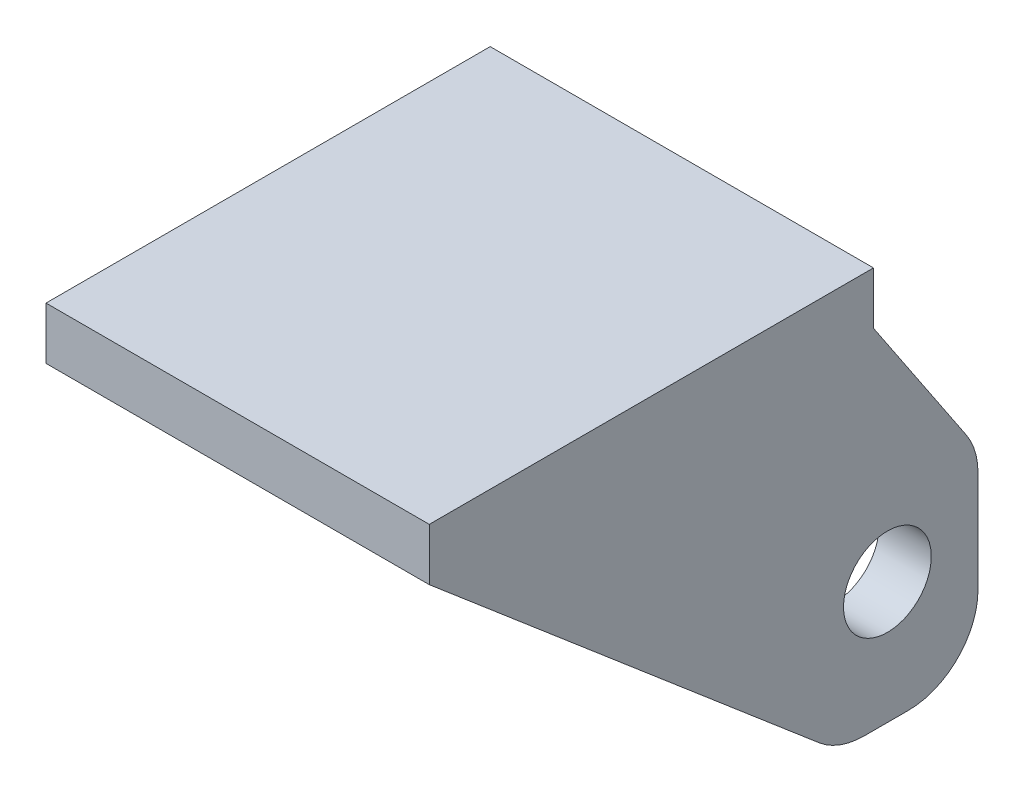
ISO-10303-21;
HEADER;
FILE_DESCRIPTION(('STEP AP214'),'2;1');
FILE_NAME('part.step','',(''),(''),'','','');
FILE_SCHEMA(('AUTOMOTIVE_DESIGN { 1 0 10303 214 1 1 1 1 }'));
ENDSEC;
DATA;
#1=APPLICATION_CONTEXT('core data for automotive mechanical design processes');
#2=APPLICATION_PROTOCOL_DEFINITION('international standard','automotive_design',2000,#1);
#3=PRODUCT_CONTEXT('',#1,'mechanical');
#4=PRODUCT('Part','Part','',(#3));
#5=PRODUCT_RELATED_PRODUCT_CATEGORY('part','',(#4));
#6=PRODUCT_DEFINITION_FORMATION('','',#4);
#7=PRODUCT_DEFINITION_CONTEXT('part definition',#1,'design');
#8=PRODUCT_DEFINITION('design','',#6,#7);
#9=PRODUCT_DEFINITION_SHAPE('','',#8);
#10=(LENGTH_UNIT() NAMED_UNIT(*) SI_UNIT(.MILLI.,.METRE.));
#11=(NAMED_UNIT(*) PLANE_ANGLE_UNIT() SI_UNIT($,.RADIAN.));
#12=(NAMED_UNIT(*) SI_UNIT($,.STERADIAN.) SOLID_ANGLE_UNIT());
#13=UNCERTAINTY_MEASURE_WITH_UNIT(LENGTH_MEASURE(1.E-05),#10,'distance_accuracy_value','');
#14=(GEOMETRIC_REPRESENTATION_CONTEXT(3) GLOBAL_UNCERTAINTY_ASSIGNED_CONTEXT((#13)) GLOBAL_UNIT_ASSIGNED_CONTEXT((#10,
#11,#12)) REPRESENTATION_CONTEXT('',''));
#15=CARTESIAN_POINT('',(0.,0.,0.));
#16=DIRECTION('',(0.,0.,1.));
#17=DIRECTION('',(1.,0.,0.));
#18=AXIS2_PLACEMENT_3D('',#15,#16,#17);
#19=CARTESIAN_POINT('',(0.,4.7625,-25.));
#20=DIRECTION('',(0.,0.,-1.));
#21=DIRECTION('',(1.,0.,0.));
#22=AXIS2_PLACEMENT_3D('',#19,#20,#21);
#23=PLANE('',#22);
#24=DIRECTION('',(0.,1.,0.));
#25=VECTOR('',#24,1.);
#26=CARTESIAN_POINT('',(-12.7,-31.75,-25.));
#27=LINE('',#26,#25);
#28=CARTESIAN_POINT('',(-12.7,-25.4,-25.));
#29=VERTEX_POINT('',#28);
#30=CARTESIAN_POINT('',(-12.7,-16.1746990921694,-25.));
#31=VERTEX_POINT('',#30);
#32=EDGE_CURVE('E338',#29,#31,#27,.T.);
#33=ORIENTED_EDGE('',*,*,#32,.F.);
#34=DIRECTION('',(-1.,0.,0.));
#35=VECTOR('',#34,1.);
#36=CARTESIAN_POINT('',(-12.7,-25.4,-25.));
#37=LINE('',#36,#35);
#38=CARTESIAN_POINT('',(-17.4625,-25.4,-25.));
#39=VERTEX_POINT('',#38);
#40=EDGE_CURVE('E263',#39,#29,#37,.F.);
#41=ORIENTED_EDGE('',*,*,#40,.F.);
#42=DIRECTION('',(0.,-1.,0.));
#43=VECTOR('',#42,1.);
#44=CARTESIAN_POINT('',(-17.4625,4.7625,-25.));
#45=LINE('',#44,#43);
#46=CARTESIAN_POINT('',(-17.4625,-16.1746990921694,-25.));
#47=VERTEX_POINT('',#46);
#48=EDGE_CURVE('E205',#47,#39,#45,.T.);
#49=ORIENTED_EDGE('',*,*,#48,.F.);
#50=DIRECTION('',(1.,0.,0.));
#51=VECTOR('',#50,1.);
#52=CARTESIAN_POINT('',(-17.4625,-16.1746990921694,-25.));
#53=LINE('',#52,#51);
#54=EDGE_CURVE('E266',#31,#47,#53,.F.);
#55=ORIENTED_EDGE('',*,*,#54,.F.);
#56=EDGE_LOOP('',(#33,#41,#49,#55));
#57=FACE_BOUND('',#56,.T.);
#58=ADVANCED_FACE('F39',(#57),#23,.T.);
#59=CARTESIAN_POINT('',(0.,0.,0.));
#60=DIRECTION('',(0.,1.,0.));
#61=DIRECTION('',(0.,0.,-1.));
#62=AXIS2_PLACEMENT_3D('',#59,#60,#61);
#63=PLANE('',#62);
#64=DIRECTION('',(-1.,0.,0.));
#65=VECTOR('',#64,1.);
#66=CARTESIAN_POINT('',(0.,0.,25.));
#67=LINE('',#66,#65);
#68=CARTESIAN_POINT('',(7.9375,0.,25.));
#69=VERTEX_POINT('',#68);
#70=CARTESIAN_POINT('',(-7.9375,0.,25.));
#71=VERTEX_POINT('',#70);
#72=EDGE_CURVE('E341',#69,#71,#67,.T.);
#73=ORIENTED_EDGE('',*,*,#72,.T.);
#74=DIRECTION('',(0.,0.,1.));
#75=VECTOR('',#74,1.);
#76=CARTESIAN_POINT('',(-7.9375,0.,0.));
#77=LINE('',#76,#75);
#78=CARTESIAN_POINT('',(-7.9375,0.,-15.475));
#79=VERTEX_POINT('',#78);
#80=EDGE_CURVE('E279',#79,#71,#77,.T.);
#81=ORIENTED_EDGE('',*,*,#80,.F.);
#82=DIRECTION('',(1.,0.,0.));
#83=VECTOR('',#82,1.);
#84=CARTESIAN_POINT('',(-17.4625,0.,-15.475));
#85=LINE('',#84,#83);
#86=CARTESIAN_POINT('',(7.9375,0.,-15.475));
#87=VERTEX_POINT('',#86);
#88=EDGE_CURVE('E365',#79,#87,#85,.T.);
#89=ORIENTED_EDGE('',*,*,#88,.T.);
#90=DIRECTION('',(0.,0.,1.));
#91=VECTOR('',#90,1.);
#92=CARTESIAN_POINT('',(7.9375,0.,-15.475));
#93=LINE('',#92,#91);
#94=EDGE_CURVE('E281',#69,#87,#93,.F.);
#95=ORIENTED_EDGE('',*,*,#94,.F.);
#96=EDGE_LOOP('',(#73,#81,#89,#95));
#97=FACE_BOUND('',#96,.T.);
#98=ADVANCED_FACE('F401',(#97),#63,.F.);
#99=CARTESIAN_POINT('',(0.,4.7625,25.));
#100=DIRECTION('',(0.,0.,-1.));
#101=DIRECTION('',(1.,0.,0.));
#102=AXIS2_PLACEMENT_3D('',#99,#100,#101);
#103=PLANE('',#102);
#104=DIRECTION('',(0.,-1.,0.));
#105=VECTOR('',#104,1.);
#106=CARTESIAN_POINT('',(17.4625,4.7625,25.));
#107=LINE('',#106,#105);
#108=CARTESIAN_POINT('',(17.4625,4.7625,25.));
#109=VERTEX_POINT('',#108);
#110=CARTESIAN_POINT('',(17.4625,0.,25.));
#111=VERTEX_POINT('',#110);
#112=EDGE_CURVE('E348',#109,#111,#107,.T.);
#113=ORIENTED_EDGE('',*,*,#112,.F.);
#114=DIRECTION('',(-1.,0.,0.));
#115=VECTOR('',#114,1.);
#116=CARTESIAN_POINT('',(0.,4.7625,25.));
#117=LINE('',#116,#115);
#118=CARTESIAN_POINT('',(-17.4625,4.7625,25.));
#119=VERTEX_POINT('',#118);
#120=EDGE_CURVE('E203',#109,#119,#117,.T.);
#121=ORIENTED_EDGE('',*,*,#120,.T.);
#122=DIRECTION('',(0.,-1.,0.));
#123=VECTOR('',#122,1.);
#124=CARTESIAN_POINT('',(-17.4625,4.7625,25.));
#125=LINE('',#124,#123);
#126=CARTESIAN_POINT('',(-17.4625,0.,25.));
#127=VERTEX_POINT('',#126);
#128=EDGE_CURVE('E186',#119,#127,#125,.T.);
#129=ORIENTED_EDGE('',*,*,#128,.T.);
#130=DIRECTION('',(1.,0.,0.));
#131=VECTOR('',#130,1.);
#132=CARTESIAN_POINT('',(-17.4625,0.,25.));
#133=LINE('',#132,#131);
#134=EDGE_CURVE('E194',#127,#71,#133,.T.);
#135=ORIENTED_EDGE('',*,*,#134,.T.);
#136=ORIENTED_EDGE('',*,*,#72,.F.);
#137=EDGE_CURVE('E191',#69,#111,#133,.T.);
#138=ORIENTED_EDGE('',*,*,#137,.T.);
#139=EDGE_LOOP('',(#113,#121,#129,#135,#136,#138));
#140=FACE_BOUND('',#139,.T.);
#141=ADVANCED_FACE('F201',(#140),#103,.F.);
#142=CARTESIAN_POINT('',(-17.4625,4.7625,0.));
#143=DIRECTION('',(1.,0.,0.));
#144=DIRECTION('',(0.,0.,1.));
#145=AXIS2_PLACEMENT_3D('',#142,#143,#144);
#146=PLANE('',#145);
#147=CARTESIAN_POINT('',(-17.4625,-20.6375,-16.745));
#148=DIRECTION('',(-1.,0.,0.));
#149=DIRECTION('',(0.,0.,1.));
#150=AXIS2_PLACEMENT_3D('',#147,#148,#149);
#151=CIRCLE('',#150,4.);
#152=CARTESIAN_POINT('',(-17.4625,-20.6375,-12.745));
#153=VERTEX_POINT('',#152);
#154=EDGE_CURVE('E380',#153,#153,#151,.T.);
#155=ORIENTED_EDGE('',*,*,#154,.F.);
#156=EDGE_LOOP('',(#155));
#157=FACE_BOUND('',#156,.T.);
#158=DIRECTION('',(0.,-0.648181604007245,-0.761485789904575));
#159=VECTOR('',#158,1.);
#160=CARTESIAN_POINT('',(-17.4625,-12.3395270182268,10.5034847943351));
#161=LINE('',#160,#159);
#162=CARTESIAN_POINT('',(-17.4625,-30.2354347658941,-10.5206839926881));
#163=VERTEX_POINT('',#162);
#164=EDGE_CURVE('E182',#127,#163,#161,.T.);
#165=ORIENTED_EDGE('',*,*,#164,.F.);
#166=ORIENTED_EDGE('',*,*,#128,.F.);
#167=DIRECTION('',(0.,0.,-1.));
#168=VECTOR('',#167,1.);
#169=CARTESIAN_POINT('',(-17.4625,4.7625,0.));
#170=LINE('',#169,#168);
#171=CARTESIAN_POINT('',(-17.4625,4.7625,-15.475));
#172=VERTEX_POINT('',#171);
#173=EDGE_CURVE('E343',#119,#172,#170,.T.);
#174=ORIENTED_EDGE('',*,*,#173,.T.);
#175=DIRECTION('',(0.,1.,0.));
#176=VECTOR('',#175,1.);
#177=CARTESIAN_POINT('',(-17.4625,0.,-15.475));
#178=LINE('',#177,#176);
#179=CARTESIAN_POINT('',(-17.4625,0.,-15.475));
#180=VERTEX_POINT('',#179);
#181=EDGE_CURVE('E364',#180,#172,#178,.T.);
#182=ORIENTED_EDGE('',*,*,#181,.F.);
#183=DIRECTION('',(0.,0.831333189373505,0.555774350115293));
#184=VECTOR('',#183,1.);
#185=CARTESIAN_POINT('',(-17.4625,7.14997093575034,-10.695002640392));
#186=LINE('',#185,#184);
#187=CARTESIAN_POINT('',(-17.4625,-12.6455319689373,-23.9289657525218));
#188=VERTEX_POINT('',#187);
#189=EDGE_CURVE('E372',#188,#180,#186,.T.);
#190=ORIENTED_EDGE('',*,*,#189,.F.);
#191=CARTESIAN_POINT('',(-17.4625,-16.1746990921694,-18.65));
#192=DIRECTION('',(-1.,0.,0.));
#193=DIRECTION('',(0.,0.,1.));
#194=AXIS2_PLACEMENT_3D('',#191,#192,#193);
#195=CIRCLE('',#194,6.35);
#196=EDGE_CURVE('E235',#47,#188,#195,.F.);
#197=ORIENTED_EDGE('',*,*,#196,.F.);
#198=ORIENTED_EDGE('',*,*,#48,.T.);
#199=CARTESIAN_POINT('',(-17.4625,-25.4,-18.65));
#200=DIRECTION('',(-1.,0.,0.));
#201=DIRECTION('',(0.,0.,1.));
#202=AXIS2_PLACEMENT_3D('',#199,#200,#201);
#203=CIRCLE('',#202,6.35);
#204=CARTESIAN_POINT('',(-17.4625,-31.75,-18.65));
#205=VERTEX_POINT('',#204);
#206=EDGE_CURVE('E233',#205,#39,#203,.F.);
#207=ORIENTED_EDGE('',*,*,#206,.F.);
#208=DIRECTION('',(0.,0.,-1.));
#209=VECTOR('',#208,1.);
#210=CARTESIAN_POINT('',(-17.4625,-31.75,0.));
#211=LINE('',#210,#209);
#212=CARTESIAN_POINT('',(-17.4625,-31.75,-14.6366371781341));
#213=VERTEX_POINT('',#212);
#214=EDGE_CURVE('E314',#213,#205,#211,.T.);
#215=ORIENTED_EDGE('',*,*,#214,.F.);
#216=CARTESIAN_POINT('',(-17.4625,-25.4,-14.6366371781341));
#217=DIRECTION('',(-1.,0.,0.));
#218=DIRECTION('',(0.,0.,1.));
#219=AXIS2_PLACEMENT_3D('',#216,#217,#218);
#220=CIRCLE('',#219,6.35);
#221=EDGE_CURVE('E190',#163,#213,#220,.F.);
#222=ORIENTED_EDGE('',*,*,#221,.F.);
#223=EDGE_LOOP('',(#165,#166,#174,#182,#190,#197,#198,#207,#215,#222));
#224=FACE_BOUND('',#223,.T.);
#225=ADVANCED_FACE('F183',(#157,#224),#146,.F.);
#226=DIRECTION('',(0.,-1.,0.));
#227=VECTOR('',#226,1.);
#228=CARTESIAN_POINT('',(17.4625,4.7625,-25.));
#229=LINE('',#228,#227);
#230=CARTESIAN_POINT('',(17.4625,-16.1746990921694,-25.));
#231=VERTEX_POINT('',#230);
#232=CARTESIAN_POINT('',(17.4625,-25.4,-25.));
#233=VERTEX_POINT('',#232);
#234=EDGE_CURVE('E211',#231,#233,#229,.T.);
#235=ORIENTED_EDGE('',*,*,#234,.T.);
#236=DIRECTION('',(1.,0.,0.));
#237=VECTOR('',#236,1.);
#238=CARTESIAN_POINT('',(17.4625,-25.4,-25.));
#239=LINE('',#238,#237);
#240=CARTESIAN_POINT('',(12.7,-25.4,-25.));
#241=VERTEX_POINT('',#240);
#242=EDGE_CURVE('E271',#241,#233,#239,.T.);
#243=ORIENTED_EDGE('',*,*,#242,.F.);
#244=DIRECTION('',(0.,1.,0.));
#245=VECTOR('',#244,1.);
#246=CARTESIAN_POINT('',(12.7,-31.75,-25.));
#247=LINE('',#246,#245);
#248=CARTESIAN_POINT('',(12.7,-16.1746990921694,-25.));
#249=VERTEX_POINT('',#248);
#250=EDGE_CURVE('E310',#241,#249,#247,.T.);
#251=ORIENTED_EDGE('',*,*,#250,.T.);
#252=DIRECTION('',(1.,0.,0.));
#253=VECTOR('',#252,1.);
#254=CARTESIAN_POINT('',(12.7,-16.1746990921694,-25.));
#255=LINE('',#254,#253);
#256=EDGE_CURVE('E274',#231,#249,#255,.F.);
#257=ORIENTED_EDGE('',*,*,#256,.F.);
#258=EDGE_LOOP('',(#235,#243,#251,#257));
#259=FACE_BOUND('',#258,.T.);
#260=ADVANCED_FACE('F318',(#259),#23,.T.);
#261=CARTESIAN_POINT('',(17.4625,4.7625,0.));
#262=DIRECTION('',(1.,0.,0.));
#263=DIRECTION('',(0.,0.,1.));
#264=AXIS2_PLACEMENT_3D('',#261,#262,#263);
#265=PLANE('',#264);
#266=DIRECTION('',(0.,0.,-1.));
#267=VECTOR('',#266,1.);
#268=CARTESIAN_POINT('',(17.4625,-31.75,0.));
#269=LINE('',#268,#267);
#270=CARTESIAN_POINT('',(17.4625,-31.75,-14.6366371781341));
#271=VERTEX_POINT('',#270);
#272=CARTESIAN_POINT('',(17.4625,-31.75,-18.65));
#273=VERTEX_POINT('',#272);
#274=EDGE_CURVE('E327',#271,#273,#269,.T.);
#275=ORIENTED_EDGE('',*,*,#274,.T.);
#276=CARTESIAN_POINT('',(17.4625,-25.4,-18.65));
#277=DIRECTION('',(-1.,0.,0.));
#278=DIRECTION('',(0.,0.,1.));
#279=AXIS2_PLACEMENT_3D('',#276,#277,#278);
#280=CIRCLE('',#279,6.35);
#281=EDGE_CURVE('E243',#233,#273,#280,.T.);
#282=ORIENTED_EDGE('',*,*,#281,.F.);
#283=ORIENTED_EDGE('',*,*,#234,.F.);
#284=CARTESIAN_POINT('',(17.4625,-16.1746990921694,-18.65));
#285=DIRECTION('',(-1.,0.,0.));
#286=DIRECTION('',(0.,0.,1.));
#287=AXIS2_PLACEMENT_3D('',#284,#285,#286);
#288=CIRCLE('',#287,6.35);
#289=CARTESIAN_POINT('',(17.4625,-12.6455319689373,-23.9289657525218));
#290=VERTEX_POINT('',#289);
#291=EDGE_CURVE('E246',#290,#231,#288,.T.);
#292=ORIENTED_EDGE('',*,*,#291,.F.);
#293=DIRECTION('',(0.,0.831333189373505,0.555774350115293));
#294=VECTOR('',#293,1.);
#295=CARTESIAN_POINT('',(17.4625,7.14997093575034,-10.695002640392));
#296=LINE('',#295,#294);
#297=CARTESIAN_POINT('',(17.4625,0.,-15.475));
#298=VERTEX_POINT('',#297);
#299=EDGE_CURVE('E302',#290,#298,#296,.T.);
#300=ORIENTED_EDGE('',*,*,#299,.T.);
#301=DIRECTION('',(0.,1.,0.));
#302=VECTOR('',#301,1.);
#303=CARTESIAN_POINT('',(17.4625,0.,-15.475));
#304=LINE('',#303,#302);
#305=CARTESIAN_POINT('',(17.4625,4.7625,-15.475));
#306=VERTEX_POINT('',#305);
#307=EDGE_CURVE('E370',#298,#306,#304,.T.);
#308=ORIENTED_EDGE('',*,*,#307,.T.);
#309=DIRECTION('',(0.,0.,-1.));
#310=VECTOR('',#309,1.);
#311=CARTESIAN_POINT('',(17.4625,4.7625,0.));
#312=LINE('',#311,#310);
#313=EDGE_CURVE('E345',#109,#306,#312,.T.);
#314=ORIENTED_EDGE('',*,*,#313,.F.);
#315=ORIENTED_EDGE('',*,*,#112,.T.);
#316=DIRECTION('',(0.,-0.648181604007245,-0.761485789904575));
#317=VECTOR('',#316,1.);
#318=CARTESIAN_POINT('',(17.4625,-12.3395270182268,10.5034847943351));
#319=LINE('',#318,#317);
#320=CARTESIAN_POINT('',(17.4625,-30.2354347658941,-10.5206839926881));
#321=VERTEX_POINT('',#320);
#322=EDGE_CURVE('E192',#111,#321,#319,.T.);
#323=ORIENTED_EDGE('',*,*,#322,.T.);
#324=CARTESIAN_POINT('',(17.4625,-25.4,-14.6366371781341));
#325=DIRECTION('',(-1.,0.,0.));
#326=DIRECTION('',(0.,0.,1.));
#327=AXIS2_PLACEMENT_3D('',#324,#325,#326);
#328=CIRCLE('',#327,6.35);
#329=EDGE_CURVE('E248',#271,#321,#328,.T.);
#330=ORIENTED_EDGE('',*,*,#329,.F.);
#331=EDGE_LOOP('',(#275,#282,#283,#292,#300,#308,#314,#315,#323,#330));
#332=FACE_BOUND('',#331,.T.);
#333=CARTESIAN_POINT('',(17.4625,-20.6375,-16.745));
#334=DIRECTION('',(-1.,0.,0.));
#335=DIRECTION('',(0.,0.,1.));
#336=AXIS2_PLACEMENT_3D('',#333,#334,#335);
#337=CIRCLE('',#336,4.);
#338=CARTESIAN_POINT('',(17.4625,-20.6375,-12.745));
#339=VERTEX_POINT('',#338);
#340=EDGE_CURVE('E369',#339,#339,#337,.T.);
#341=ORIENTED_EDGE('',*,*,#340,.T.);
#342=EDGE_LOOP('',(#341));
#343=FACE_BOUND('',#342,.T.);
#344=ADVANCED_FACE('F354',(#332,#343),#265,.T.);
#345=CARTESIAN_POINT('',(0.,4.7625,0.));
#346=DIRECTION('',(0.,1.,0.));
#347=DIRECTION('',(0.,0.,-1.));
#348=AXIS2_PLACEMENT_3D('',#345,#346,#347);
#349=PLANE('',#348);
#350=DIRECTION('',(1.,0.,0.));
#351=VECTOR('',#350,1.);
#352=CARTESIAN_POINT('',(-17.4625,4.7625,-15.475));
#353=LINE('',#352,#351);
#354=EDGE_CURVE('E367',#172,#306,#353,.T.);
#355=ORIENTED_EDGE('',*,*,#354,.F.);
#356=ORIENTED_EDGE('',*,*,#173,.F.);
#357=ORIENTED_EDGE('',*,*,#120,.F.);
#358=ORIENTED_EDGE('',*,*,#313,.T.);
#359=EDGE_LOOP('',(#355,#356,#357,#358));
#360=FACE_BOUND('',#359,.T.);
#361=ADVANCED_FACE('F417',(#360),#349,.T.);
#362=CARTESIAN_POINT('',(-12.7,-31.75,0.));
#363=DIRECTION('',(1.,0.,0.));
#364=DIRECTION('',(0.,0.,1.));
#365=AXIS2_PLACEMENT_3D('',#362,#363,#364);
#366=PLANE('',#365);
#367=DIRECTION('',(0.,-0.648181604007245,-0.761485789904575));
#368=VECTOR('',#367,1.);
#369=CARTESIAN_POINT('',(-12.7,-25.6789527070324,-5.16771451881289));
#370=LINE('',#369,#368);
#371=CARTESIAN_POINT('',(-12.7,-4.76249999999999,19.405));
#372=VERTEX_POINT('',#371);
#373=CARTESIAN_POINT('',(-12.7,-30.235434765894,-10.5206839926881));
#374=VERTEX_POINT('',#373);
#375=EDGE_CURVE('E218',#372,#374,#370,.T.);
#376=ORIENTED_EDGE('',*,*,#375,.T.);
#377=CARTESIAN_POINT('',(-12.7,-25.4,-14.6366371781341));
#378=DIRECTION('',(-1.,0.,0.));
#379=DIRECTION('',(0.,0.,1.));
#380=AXIS2_PLACEMENT_3D('',#377,#378,#379);
#381=CIRCLE('',#380,6.35);
#382=CARTESIAN_POINT('',(-12.7,-31.75,-14.6366371781341));
#383=VERTEX_POINT('',#382);
#384=EDGE_CURVE('E228',#383,#374,#381,.T.);
#385=ORIENTED_EDGE('',*,*,#384,.F.);
#386=DIRECTION('',(0.,0.,1.));
#387=VECTOR('',#386,1.);
#388=CARTESIAN_POINT('',(-12.7,-31.75,0.));
#389=LINE('',#388,#387);
#390=CARTESIAN_POINT('',(-12.7,-31.75,-18.65));
#391=VERTEX_POINT('',#390);
#392=EDGE_CURVE('E335',#391,#383,#389,.T.);
#393=ORIENTED_EDGE('',*,*,#392,.F.);
#394=CARTESIAN_POINT('',(-12.7,-25.4,-18.65));
#395=DIRECTION('',(-1.,0.,0.));
#396=DIRECTION('',(0.,0.,1.));
#397=AXIS2_PLACEMENT_3D('',#394,#395,#396);
#398=CIRCLE('',#397,6.35);
#399=EDGE_CURVE('E223',#29,#391,#398,.T.);
#400=ORIENTED_EDGE('',*,*,#399,.F.);
#401=ORIENTED_EDGE('',*,*,#32,.T.);
#402=CARTESIAN_POINT('',(-12.7,-16.1746990921694,-18.65));
#403=DIRECTION('',(-1.,0.,0.));
#404=DIRECTION('',(0.,0.,1.));
#405=AXIS2_PLACEMENT_3D('',#402,#403,#404);
#406=CIRCLE('',#405,6.35);
#407=CARTESIAN_POINT('',(-12.7,-12.6455319689373,-23.9289657525218));
#408=VERTEX_POINT('',#407);
#409=EDGE_CURVE('E226',#408,#31,#406,.T.);
#410=ORIENTED_EDGE('',*,*,#409,.F.);
#411=DIRECTION('',(0.,0.831333189373505,0.555774350115293));
#412=VECTOR('',#411,1.);
#413=CARTESIAN_POINT('',(-12.7,-14.7929262424368,-25.3645714423353));
#414=LINE('',#413,#412);
#415=CARTESIAN_POINT('',(-12.7,-4.7625,-18.6588923024579));
#416=VERTEX_POINT('',#415);
#417=EDGE_CURVE('E329',#408,#416,#414,.T.);
#418=ORIENTED_EDGE('',*,*,#417,.T.);
#419=DIRECTION('',(0.,0.,1.));
#420=VECTOR('',#419,1.);
#421=CARTESIAN_POINT('',(-12.7,-4.7625,0.));
#422=LINE('',#421,#420);
#423=EDGE_CURVE('E283',#372,#416,#422,.F.);
#424=ORIENTED_EDGE('',*,*,#423,.F.);
#425=EDGE_LOOP('',(#376,#385,#393,#400,#401,#410,#418,#424));
#426=FACE_BOUND('',#425,.T.);
#427=CARTESIAN_POINT('',(-12.7,-20.6375,-16.745));
#428=DIRECTION('',(-1.,0.,0.));
#429=DIRECTION('',(0.,0.,1.));
#430=AXIS2_PLACEMENT_3D('',#427,#428,#429);
#431=CIRCLE('',#430,4.);
#432=CARTESIAN_POINT('',(-12.7,-20.6375,-12.745));
#433=VERTEX_POINT('',#432);
#434=EDGE_CURVE('E217',#433,#433,#431,.T.);
#435=ORIENTED_EDGE('',*,*,#434,.T.);
#436=EDGE_LOOP('',(#435));
#437=FACE_BOUND('',#436,.T.);
#438=ADVANCED_FACE('F391',(#426,#437),#366,.T.);
#439=CARTESIAN_POINT('',(0.,-31.75,0.));
#440=DIRECTION('',(0.,1.,0.));
#441=DIRECTION('',(0.,0.,-1.));
#442=AXIS2_PLACEMENT_3D('',#439,#440,#441);
#443=PLANE('',#442);
#444=ORIENTED_EDGE('',*,*,#214,.T.);
#445=DIRECTION('',(-1.,0.,0.));
#446=VECTOR('',#445,1.);
#447=CARTESIAN_POINT('',(-17.4625,-31.75,-18.65));
#448=LINE('',#447,#446);
#449=EDGE_CURVE('E208',#391,#205,#448,.T.);
#450=ORIENTED_EDGE('',*,*,#449,.F.);
#451=ORIENTED_EDGE('',*,*,#392,.T.);
#452=DIRECTION('',(1.,0.,0.));
#453=VECTOR('',#452,1.);
#454=CARTESIAN_POINT('',(0.,-31.75,-14.6366371781341));
#455=LINE('',#454,#453);
#456=EDGE_CURVE('E221',#213,#383,#455,.T.);
#457=ORIENTED_EDGE('',*,*,#456,.F.);
#458=EDGE_LOOP('',(#444,#450,#451,#457));
#459=FACE_BOUND('',#458,.T.);
#460=ADVANCED_FACE('F552',(#459),#443,.F.);
#461=CARTESIAN_POINT('',(12.7,-31.75,0.));
#462=DIRECTION('',(1.,0.,0.));
#463=DIRECTION('',(0.,0.,1.));
#464=AXIS2_PLACEMENT_3D('',#461,#462,#463);
#465=PLANE('',#464);
#466=CARTESIAN_POINT('',(12.7,-20.6375,-16.745));
#467=DIRECTION('',(-1.,0.,0.));
#468=DIRECTION('',(0.,0.,1.));
#469=AXIS2_PLACEMENT_3D('',#466,#467,#468);
#470=CIRCLE('',#469,4.);
#471=CARTESIAN_POINT('',(12.7,-20.6375,-12.745));
#472=VERTEX_POINT('',#471);
#473=EDGE_CURVE('E215',#472,#472,#470,.T.);
#474=ORIENTED_EDGE('',*,*,#473,.F.);
#475=EDGE_LOOP('',(#474));
#476=FACE_BOUND('',#475,.T.);
#477=DIRECTION('',(0.,0.831333189373505,0.555774350115293));
#478=VECTOR('',#477,1.);
#479=CARTESIAN_POINT('',(12.7,-14.7929262424368,-25.3645714423353));
#480=LINE('',#479,#478);
#481=CARTESIAN_POINT('',(12.7,-12.6455319689373,-23.9289657525218));
#482=VERTEX_POINT('',#481);
#483=CARTESIAN_POINT('',(12.7,-4.7625,-18.6588923024579));
#484=VERTEX_POINT('',#483);
#485=EDGE_CURVE('E204',#482,#484,#480,.T.);
#486=ORIENTED_EDGE('',*,*,#485,.F.);
#487=CARTESIAN_POINT('',(12.7,-16.1746990921694,-18.65));
#488=DIRECTION('',(-1.,0.,0.));
#489=DIRECTION('',(0.,0.,1.));
#490=AXIS2_PLACEMENT_3D('',#487,#488,#489);
#491=CIRCLE('',#490,6.35);
#492=EDGE_CURVE('E255',#249,#482,#491,.F.);
#493=ORIENTED_EDGE('',*,*,#492,.F.);
#494=ORIENTED_EDGE('',*,*,#250,.F.);
#495=CARTESIAN_POINT('',(12.7,-25.4,-18.65));
#496=DIRECTION('',(-1.,0.,0.));
#497=DIRECTION('',(0.,0.,1.));
#498=AXIS2_PLACEMENT_3D('',#495,#496,#497);
#499=CIRCLE('',#498,6.35);
#500=CARTESIAN_POINT('',(12.7,-31.75,-18.65));
#501=VERTEX_POINT('',#500);
#502=EDGE_CURVE('E253',#501,#241,#499,.F.);
#503=ORIENTED_EDGE('',*,*,#502,.F.);
#504=DIRECTION('',(0.,0.,1.));
#505=VECTOR('',#504,1.);
#506=CARTESIAN_POINT('',(12.7,-31.75,0.));
#507=LINE('',#506,#505);
#508=CARTESIAN_POINT('',(12.7,-31.75,-14.6366371781341));
#509=VERTEX_POINT('',#508);
#510=EDGE_CURVE('E315',#501,#509,#507,.T.);
#511=ORIENTED_EDGE('',*,*,#510,.T.);
#512=CARTESIAN_POINT('',(12.7,-25.4,-14.6366371781341));
#513=DIRECTION('',(-1.,0.,0.));
#514=DIRECTION('',(0.,0.,1.));
#515=AXIS2_PLACEMENT_3D('',#512,#513,#514);
#516=CIRCLE('',#515,6.35);
#517=CARTESIAN_POINT('',(12.7,-30.235434765894,-10.5206839926881));
#518=VERTEX_POINT('',#517);
#519=EDGE_CURVE('E258',#518,#509,#516,.F.);
#520=ORIENTED_EDGE('',*,*,#519,.F.);
#521=DIRECTION('',(0.,-0.648181604007245,-0.761485789904575));
#522=VECTOR('',#521,1.);
#523=CARTESIAN_POINT('',(12.7,-25.6789527070324,-5.16771451881289));
#524=LINE('',#523,#522);
#525=CARTESIAN_POINT('',(12.7,-4.76249999999999,19.405));
#526=VERTEX_POINT('',#525);
#527=EDGE_CURVE('E198',#526,#518,#524,.T.);
#528=ORIENTED_EDGE('',*,*,#527,.F.);
#529=DIRECTION('',(0.,0.,1.));
#530=VECTOR('',#529,1.);
#531=CARTESIAN_POINT('',(12.7,-4.7625,25.));
#532=LINE('',#531,#530);
#533=EDGE_CURVE('E277',#484,#526,#532,.T.);
#534=ORIENTED_EDGE('',*,*,#533,.F.);
#535=EDGE_LOOP('',(#486,#493,#494,#503,#511,#520,#528,#534));
#536=FACE_BOUND('',#535,.T.);
#537=ADVANCED_FACE('F296',(#476,#536),#465,.F.);
#538=CARTESIAN_POINT('',(0.,-31.75,0.));
#539=DIRECTION('',(0.,1.,0.));
#540=DIRECTION('',(0.,0.,-1.));
#541=AXIS2_PLACEMENT_3D('',#538,#539,#540);
#542=PLANE('',#541);
#543=ORIENTED_EDGE('',*,*,#510,.F.);
#544=DIRECTION('',(1.,0.,0.));
#545=VECTOR('',#544,1.);
#546=CARTESIAN_POINT('',(12.7,-31.75,-18.65));
#547=LINE('',#546,#545);
#548=EDGE_CURVE('E239',#273,#501,#547,.F.);
#549=ORIENTED_EDGE('',*,*,#548,.F.);
#550=ORIENTED_EDGE('',*,*,#274,.F.);
#551=DIRECTION('',(1.,0.,0.));
#552=VECTOR('',#551,1.);
#553=CARTESIAN_POINT('',(0.,-31.75,-14.6366371781341));
#554=LINE('',#553,#552);
#555=EDGE_CURVE('E241',#509,#271,#554,.T.);
#556=ORIENTED_EDGE('',*,*,#555,.F.);
#557=EDGE_LOOP('',(#543,#549,#550,#556));
#558=FACE_BOUND('',#557,.T.);
#559=ADVANCED_FACE('F326',(#558),#542,.F.);
#560=CARTESIAN_POINT('',(-17.4625,-12.3395270182268,10.5034847943351));
#561=DIRECTION('',(0.,0.761485789904575,-0.648181604007245));
#562=DIRECTION('',(0.,-0.648181604007245,-0.761485789904575));
#563=AXIS2_PLACEMENT_3D('',#560,#561,#562);
#564=PLANE('',#563);
#565=ORIENTED_EDGE('',*,*,#322,.F.);
#566=ORIENTED_EDGE('',*,*,#137,.F.);
#567=CARTESIAN_POINT('',(7.9375,-4.7625,19.405));
#568=DIRECTION('',(0.,-0.761485789904575,0.648181604007245));
#569=DIRECTION('',(0.,-0.648181604007245,-0.761485789904575));
#570=AXIS2_PLACEMENT_3D('',#567,#568,#569);
#571=ELLIPSE('',#570,7.3474778836006,4.7625);
#572=EDGE_CURVE('E61',#526,#69,#571,.T.);
#573=ORIENTED_EDGE('',*,*,#572,.F.);
#574=ORIENTED_EDGE('',*,*,#527,.T.);
#575=DIRECTION('',(1.,0.,0.));
#576=VECTOR('',#575,1.);
#577=CARTESIAN_POINT('',(-17.4625,-30.2354347658941,-10.5206839926881));
#578=LINE('',#577,#576);
#579=EDGE_CURVE('E251',#321,#518,#578,.F.);
#580=ORIENTED_EDGE('',*,*,#579,.F.);
#581=EDGE_LOOP('',(#565,#566,#573,#574,#580));
#582=FACE_BOUND('',#581,.T.);
#583=ADVANCED_FACE('F504',(#582),#564,.F.);
#584=CARTESIAN_POINT('',(-17.4625,-20.6375,-16.745));
#585=DIRECTION('',(1.,0.,0.));
#586=DIRECTION('',(0.,0.,1.));
#587=AXIS2_PLACEMENT_3D('',#584,#585,#586);
#588=CYLINDRICAL_SURFACE('',#587,4.);
#589=ORIENTED_EDGE('',*,*,#340,.F.);
#590=EDGE_LOOP('',(#589));
#591=FACE_BOUND('',#590,.T.);
#592=ORIENTED_EDGE('',*,*,#473,.T.);
#593=EDGE_LOOP('',(#592));
#594=FACE_BOUND('',#593,.T.);
#595=ADVANCED_FACE('F495',(#591,#594),#588,.F.);
#596=CARTESIAN_POINT('',(-17.4625,7.14997093575034,-10.695002640392));
#597=DIRECTION('',(0.,-0.555774350115293,0.831333189373505));
#598=DIRECTION('',(0.,0.831333189373505,0.555774350115293));
#599=AXIS2_PLACEMENT_3D('',#596,#597,#598);
#600=PLANE('',#599);
#601=ORIENTED_EDGE('',*,*,#485,.T.);
#602=CARTESIAN_POINT('',(7.9375,-4.7625,-18.6588923024579));
#603=DIRECTION('',(0.,0.555774350115293,-0.831333189373505));
#604=DIRECTION('',(0.,-0.831333189373505,-0.555774350115293));
#605=AXIS2_PLACEMENT_3D('',#602,#603,#604);
#606=ELLIPSE('',#605,5.72874998962694,4.7625);
#607=EDGE_CURVE('E286',#87,#484,#606,.T.);
#608=ORIENTED_EDGE('',*,*,#607,.F.);
#609=EDGE_CURVE('E366',#87,#298,#85,.T.);
#610=ORIENTED_EDGE('',*,*,#609,.T.);
#611=ORIENTED_EDGE('',*,*,#299,.F.);
#612=DIRECTION('',(1.,0.,0.));
#613=VECTOR('',#612,1.);
#614=CARTESIAN_POINT('',(17.4625,-12.6455319689373,-23.9289657525218));
#615=LINE('',#614,#613);
#616=EDGE_CURVE('E269',#482,#290,#615,.T.);
#617=ORIENTED_EDGE('',*,*,#616,.F.);
#618=EDGE_LOOP('',(#601,#608,#610,#611,#617));
#619=FACE_BOUND('',#618,.T.);
#620=ADVANCED_FACE('F299',(#619),#600,.F.);
#621=ORIENTED_EDGE('',*,*,#189,.T.);
#622=EDGE_CURVE('E362',#180,#79,#85,.T.);
#623=ORIENTED_EDGE('',*,*,#622,.T.);
#624=CARTESIAN_POINT('',(-7.9375,-4.7625,-18.6588923024579));
#625=DIRECTION('',(0.,0.555774350115293,-0.831333189373505));
#626=DIRECTION('',(0.,0.831333189373505,0.555774350115293));
#627=AXIS2_PLACEMENT_3D('',#624,#625,#626);
#628=ELLIPSE('',#627,5.72874998962694,4.7625);
#629=EDGE_CURVE('E11',#416,#79,#628,.T.);
#630=ORIENTED_EDGE('',*,*,#629,.F.);
#631=ORIENTED_EDGE('',*,*,#417,.F.);
#632=DIRECTION('',(1.,0.,0.));
#633=VECTOR('',#632,1.);
#634=CARTESIAN_POINT('',(-12.7,-12.6455319689373,-23.9289657525218));
#635=LINE('',#634,#633);
#636=EDGE_CURVE('E261',#188,#408,#635,.T.);
#637=ORIENTED_EDGE('',*,*,#636,.F.);
#638=EDGE_LOOP('',(#621,#623,#630,#631,#637));
#639=FACE_BOUND('',#638,.T.);
#640=ADVANCED_FACE('F394',(#639),#600,.F.);
#641=CARTESIAN_POINT('',(-17.4625,0.,-15.475));
#642=DIRECTION('',(0.,0.,1.));
#643=DIRECTION('',(-1.,0.,0.));
#644=AXIS2_PLACEMENT_3D('',#641,#642,#643);
#645=PLANE('',#644);
#646=ORIENTED_EDGE('',*,*,#307,.F.);
#647=ORIENTED_EDGE('',*,*,#609,.F.);
#648=ORIENTED_EDGE('',*,*,#88,.F.);
#649=ORIENTED_EDGE('',*,*,#622,.F.);
#650=ORIENTED_EDGE('',*,*,#181,.T.);
#651=ORIENTED_EDGE('',*,*,#354,.T.);
#652=EDGE_LOOP('',(#646,#647,#648,#649,#650,#651));
#653=FACE_BOUND('',#652,.T.);
#654=ADVANCED_FACE('F502',(#653),#645,.F.);
#655=ORIENTED_EDGE('',*,*,#134,.F.);
#656=ORIENTED_EDGE('',*,*,#164,.T.);
#657=DIRECTION('',(1.,0.,0.));
#658=VECTOR('',#657,1.);
#659=CARTESIAN_POINT('',(-17.4625,-30.2354347658941,-10.5206839926881));
#660=LINE('',#659,#658);
#661=EDGE_CURVE('E231',#374,#163,#660,.F.);
#662=ORIENTED_EDGE('',*,*,#661,.F.);
#663=ORIENTED_EDGE('',*,*,#375,.F.);
#664=CARTESIAN_POINT('',(-7.9375,-4.7625,19.405));
#665=DIRECTION('',(0.,-0.761485789904575,0.648181604007245));
#666=DIRECTION('',(0.,0.648181604007245,0.761485789904575));
#667=AXIS2_PLACEMENT_3D('',#664,#665,#666);
#668=ELLIPSE('',#667,7.3474778836006,4.7625);
#669=EDGE_CURVE('E47',#71,#372,#668,.T.);
#670=ORIENTED_EDGE('',*,*,#669,.F.);
#671=EDGE_LOOP('',(#655,#656,#662,#663,#670));
#672=FACE_BOUND('',#671,.T.);
#673=ADVANCED_FACE('F195',(#672),#564,.F.);
#674=ORIENTED_EDGE('',*,*,#434,.F.);
#675=EDGE_LOOP('',(#674));
#676=FACE_BOUND('',#675,.T.);
#677=ORIENTED_EDGE('',*,*,#154,.T.);
#678=EDGE_LOOP('',(#677));
#679=FACE_BOUND('',#678,.T.);
#680=ADVANCED_FACE('F429',(#676,#679),#588,.F.);
#681=CARTESIAN_POINT('',(0.,-25.4,-14.6366371781341));
#682=DIRECTION('',(1.,0.,0.));
#683=DIRECTION('',(0.,0.,1.));
#684=AXIS2_PLACEMENT_3D('',#681,#682,#683);
#685=CYLINDRICAL_SURFACE('',#684,6.35);
#686=ORIENTED_EDGE('',*,*,#221,.T.);
#687=ORIENTED_EDGE('',*,*,#456,.T.);
#688=ORIENTED_EDGE('',*,*,#384,.T.);
#689=ORIENTED_EDGE('',*,*,#661,.T.);
#690=EDGE_LOOP('',(#686,#687,#688,#689));
#691=FACE_BOUND('',#690,.T.);
#692=ADVANCED_FACE('F425',(#691),#685,.T.);
#693=CARTESIAN_POINT('',(0.,-25.4,-14.6366371781341));
#694=DIRECTION('',(1.,0.,0.));
#695=DIRECTION('',(0.,0.,1.));
#696=AXIS2_PLACEMENT_3D('',#693,#694,#695);
#697=CYLINDRICAL_SURFACE('',#696,6.35);
#698=ORIENTED_EDGE('',*,*,#519,.T.);
#699=ORIENTED_EDGE('',*,*,#555,.T.);
#700=ORIENTED_EDGE('',*,*,#329,.T.);
#701=ORIENTED_EDGE('',*,*,#579,.T.);
#702=EDGE_LOOP('',(#698,#699,#700,#701));
#703=FACE_BOUND('',#702,.T.);
#704=ADVANCED_FACE('F428',(#703),#697,.T.);
#705=CARTESIAN_POINT('',(-17.4625,-16.1746990921694,-18.65));
#706=DIRECTION('',(-1.,0.,0.));
#707=DIRECTION('',(0.,-1.,0.));
#708=AXIS2_PLACEMENT_3D('',#705,#706,#707);
#709=CYLINDRICAL_SURFACE('',#708,6.35);
#710=ORIENTED_EDGE('',*,*,#196,.T.);
#711=ORIENTED_EDGE('',*,*,#636,.T.);
#712=ORIENTED_EDGE('',*,*,#409,.T.);
#713=ORIENTED_EDGE('',*,*,#54,.T.);
#714=EDGE_LOOP('',(#710,#711,#712,#713));
#715=FACE_BOUND('',#714,.T.);
#716=ADVANCED_FACE('F433',(#715),#709,.T.);
#717=CARTESIAN_POINT('',(-17.4625,-16.1746990921694,-18.65));
#718=DIRECTION('',(-1.,0.,0.));
#719=DIRECTION('',(0.,-1.,0.));
#720=AXIS2_PLACEMENT_3D('',#717,#718,#719);
#721=CYLINDRICAL_SURFACE('',#720,6.35);
#722=ORIENTED_EDGE('',*,*,#492,.T.);
#723=ORIENTED_EDGE('',*,*,#616,.T.);
#724=ORIENTED_EDGE('',*,*,#291,.T.);
#725=ORIENTED_EDGE('',*,*,#256,.T.);
#726=EDGE_LOOP('',(#722,#723,#724,#725));
#727=FACE_BOUND('',#726,.T.);
#728=ADVANCED_FACE('F305',(#727),#721,.T.);
#729=CARTESIAN_POINT('',(0.,-25.4,-18.65));
#730=DIRECTION('',(1.,0.,0.));
#731=DIRECTION('',(0.,0.,1.));
#732=AXIS2_PLACEMENT_3D('',#729,#730,#731);
#733=CYLINDRICAL_SURFACE('',#732,6.35);
#734=ORIENTED_EDGE('',*,*,#399,.T.);
#735=ORIENTED_EDGE('',*,*,#449,.T.);
#736=ORIENTED_EDGE('',*,*,#206,.T.);
#737=ORIENTED_EDGE('',*,*,#40,.T.);
#738=EDGE_LOOP('',(#734,#735,#736,#737));
#739=FACE_BOUND('',#738,.T.);
#740=ADVANCED_FACE('F440',(#739),#733,.T.);
#741=CARTESIAN_POINT('',(0.,-25.4,-18.65));
#742=DIRECTION('',(-1.,0.,0.));
#743=DIRECTION('',(0.,0.,-1.));
#744=AXIS2_PLACEMENT_3D('',#741,#742,#743);
#745=CYLINDRICAL_SURFACE('',#744,6.35);
#746=ORIENTED_EDGE('',*,*,#502,.T.);
#747=ORIENTED_EDGE('',*,*,#242,.T.);
#748=ORIENTED_EDGE('',*,*,#281,.T.);
#749=ORIENTED_EDGE('',*,*,#548,.T.);
#750=EDGE_LOOP('',(#746,#747,#748,#749));
#751=FACE_BOUND('',#750,.T.);
#752=ADVANCED_FACE('F321',(#751),#745,.T.);
#753=CARTESIAN_POINT('',(7.9375,-4.7625,0.));
#754=DIRECTION('',(0.,0.,-1.));
#755=DIRECTION('',(1.,0.,0.));
#756=AXIS2_PLACEMENT_3D('',#753,#754,#755);
#757=CYLINDRICAL_SURFACE('',#756,4.7625);
#758=ORIENTED_EDGE('',*,*,#607,.T.);
#759=ORIENTED_EDGE('',*,*,#533,.T.);
#760=ORIENTED_EDGE('',*,*,#572,.T.);
#761=ORIENTED_EDGE('',*,*,#94,.T.);
#762=EDGE_LOOP('',(#758,#759,#760,#761));
#763=FACE_BOUND('',#762,.T.);
#764=ADVANCED_FACE('F289',(#763),#757,.F.);
#765=CARTESIAN_POINT('',(-7.9375,-4.7625,0.));
#766=DIRECTION('',(0.,0.,1.));
#767=DIRECTION('',(-1.,0.,0.));
#768=AXIS2_PLACEMENT_3D('',#765,#766,#767);
#769=CYLINDRICAL_SURFACE('',#768,4.7625);
#770=ORIENTED_EDGE('',*,*,#629,.T.);
#771=ORIENTED_EDGE('',*,*,#80,.T.);
#772=ORIENTED_EDGE('',*,*,#669,.T.);
#773=ORIENTED_EDGE('',*,*,#423,.T.);
#774=EDGE_LOOP('',(#770,#771,#772,#773));
#775=FACE_BOUND('',#774,.T.);
#776=ADVANCED_FACE('F41',(#775),#769,.F.);
#777=CLOSED_SHELL('',(#58,#98,#141,#225,#260,#344,#361,#438,#460,#537,#559,#583,#595,#620,#640,
#654,#673,#680,#692,#704,#716,#728,#740,#752,#764,#776));
#778=MANIFOLD_SOLID_BREP('B2',#777);
#779=ADVANCED_BREP_SHAPE_REPRESENTATION('',(#18,#778),#14);
#780=SHAPE_DEFINITION_REPRESENTATION(#9,#779);
ENDSEC;
END-ISO-10303-21;
